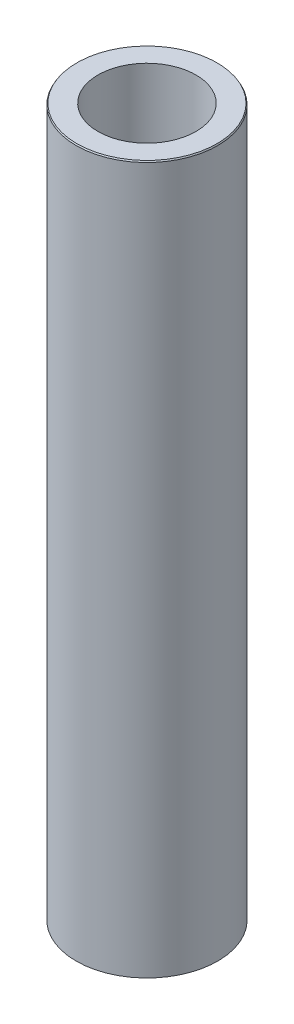
ISO-10303-21;
HEADER;
FILE_DESCRIPTION(('STEP AP214'),'2;1');
FILE_NAME('part.step','',(''),(''),'','','');
FILE_SCHEMA(('AUTOMOTIVE_DESIGN { 1 0 10303 214 1 1 1 1 }'));
ENDSEC;
DATA;
#1=APPLICATION_CONTEXT('core data for automotive mechanical design processes');
#2=APPLICATION_PROTOCOL_DEFINITION('international standard','automotive_design',2000,#1);
#3=PRODUCT_CONTEXT('',#1,'mechanical');
#4=PRODUCT('Part','Part','',(#3));
#5=PRODUCT_RELATED_PRODUCT_CATEGORY('part','',(#4));
#6=PRODUCT_DEFINITION_FORMATION('','',#4);
#7=PRODUCT_DEFINITION_CONTEXT('part definition',#1,'design');
#8=PRODUCT_DEFINITION('design','',#6,#7);
#9=PRODUCT_DEFINITION_SHAPE('','',#8);
#10=(LENGTH_UNIT() NAMED_UNIT(*) SI_UNIT(.MILLI.,.METRE.));
#11=(NAMED_UNIT(*) PLANE_ANGLE_UNIT() SI_UNIT($,.RADIAN.));
#12=(NAMED_UNIT(*) SI_UNIT($,.STERADIAN.) SOLID_ANGLE_UNIT());
#13=UNCERTAINTY_MEASURE_WITH_UNIT(LENGTH_MEASURE(1.E-05),#10,'distance_accuracy_value','');
#14=(GEOMETRIC_REPRESENTATION_CONTEXT(3) GLOBAL_UNCERTAINTY_ASSIGNED_CONTEXT((#13)) GLOBAL_UNIT_ASSIGNED_CONTEXT((#10,
#11,#12)) REPRESENTATION_CONTEXT('',''));
#15=CARTESIAN_POINT('',(0.,0.,0.));
#16=DIRECTION('',(0.,0.,1.));
#17=DIRECTION('',(1.,0.,0.));
#18=AXIS2_PLACEMENT_3D('',#15,#16,#17);
#19=CARTESIAN_POINT('',(0.,600.,0.));
#20=DIRECTION('',(0.,-1.,0.));
#21=DIRECTION('',(0.,0.,-1.));
#22=AXIS2_PLACEMENT_3D('',#19,#20,#21);
#23=CYLINDRICAL_SURFACE('',#22,60.);
#24=CARTESIAN_POINT('',(0.,598.909788159018,0.));
#25=DIRECTION('',(0.,1.,0.));
#26=DIRECTION('',(0.,0.,1.));
#27=AXIS2_PLACEMENT_3D('',#24,#25,#26);
#28=CIRCLE('',#27,60.);
#29=CARTESIAN_POINT('',(0.,598.909788159018,60.));
#30=VERTEX_POINT('',#29);
#31=EDGE_CURVE('E50',#30,#30,#28,.F.);
#32=ORIENTED_EDGE('',*,*,#31,.T.);
#33=EDGE_LOOP('',(#32));
#34=FACE_BOUND('',#33,.T.);
#35=CARTESIAN_POINT('',(0.,0.62943409986449,0.));
#36=DIRECTION('',(0.,1.,0.));
#37=DIRECTION('',(0.,0.,1.));
#38=AXIS2_PLACEMENT_3D('',#35,#36,#37);
#39=CIRCLE('',#38,60.);
#40=CARTESIAN_POINT('',(0.,0.62943409986449,60.));
#41=VERTEX_POINT('',#40);
#42=EDGE_CURVE('E51',#41,#41,#39,.T.);
#43=ORIENTED_EDGE('',*,*,#42,.T.);
#44=EDGE_LOOP('',(#43));
#45=FACE_BOUND('',#44,.T.);
#46=ADVANCED_FACE('F39',(#34,#45),#23,.T.);
#47=CARTESIAN_POINT('',(0.,600.,0.));
#48=DIRECTION('',(0.,1.,0.));
#49=DIRECTION('',(0.,0.,1.));
#50=AXIS2_PLACEMENT_3D('',#47,#48,#49);
#51=PLANE('',#50);
#52=CARTESIAN_POINT('',(0.,600.,0.));
#53=DIRECTION('',(0.,1.,0.));
#54=DIRECTION('',(0.,0.,1.));
#55=AXIS2_PLACEMENT_3D('',#52,#53,#54);
#56=CIRCLE('',#55,59.3705659001356);
#57=CARTESIAN_POINT('',(0.,600.,59.3705659001356));
#58=VERTEX_POINT('',#57);
#59=EDGE_CURVE('E54',#58,#58,#56,.T.);
#60=ORIENTED_EDGE('',*,*,#59,.T.);
#61=EDGE_LOOP('',(#60));
#62=FACE_BOUND('',#61,.T.);
#63=CARTESIAN_POINT('',(0.,600.,0.));
#64=DIRECTION('',(0.,1.,0.));
#65=DIRECTION('',(0.,0.,1.));
#66=AXIS2_PLACEMENT_3D('',#63,#64,#65);
#67=CIRCLE('',#66,41.5115025601085);
#68=CARTESIAN_POINT('',(0.,600.,41.5115025601085));
#69=VERTEX_POINT('',#68);
#70=EDGE_CURVE('E58',#69,#69,#67,.T.);
#71=ORIENTED_EDGE('',*,*,#70,.F.);
#72=EDGE_LOOP('',(#71));
#73=FACE_BOUND('',#72,.T.);
#74=ADVANCED_FACE('F69',(#62,#73),#51,.T.);
#75=CARTESIAN_POINT('',(0.,0.,0.));
#76=DIRECTION('',(0.,1.,0.));
#77=DIRECTION('',(0.,0.,1.));
#78=AXIS2_PLACEMENT_3D('',#75,#76,#77);
#79=PLANE('',#78);
#80=CARTESIAN_POINT('',(0.,0.,0.));
#81=DIRECTION('',(0.,1.,0.));
#82=DIRECTION('',(0.,0.,1.));
#83=AXIS2_PLACEMENT_3D('',#80,#81,#82);
#84=CIRCLE('',#83,58.9097881590181);
#85=CARTESIAN_POINT('',(0.,0.,58.9097881590181));
#86=VERTEX_POINT('',#85);
#87=EDGE_CURVE('E10',#86,#86,#84,.F.);
#88=ORIENTED_EDGE('',*,*,#87,.T.);
#89=EDGE_LOOP('',(#88));
#90=FACE_BOUND('',#89,.T.);
#91=CARTESIAN_POINT('',(0.,0.,0.));
#92=DIRECTION('',(0.,1.,0.));
#93=DIRECTION('',(0.,0.,1.));
#94=AXIS2_PLACEMENT_3D('',#91,#92,#93);
#95=CIRCLE('',#94,41.5115025601085);
#96=CARTESIAN_POINT('',(0.,0.,41.5115025601085));
#97=VERTEX_POINT('',#96);
#98=EDGE_CURVE('E63',#97,#97,#95,.T.);
#99=ORIENTED_EDGE('',*,*,#98,.T.);
#100=EDGE_LOOP('',(#99));
#101=FACE_BOUND('',#100,.T.);
#102=ADVANCED_FACE('F75',(#90,#101),#79,.F.);
#103=CARTESIAN_POINT('',(0.,600.,0.));
#104=DIRECTION('',(0.,-1.,0.));
#105=DIRECTION('',(0.,0.,-1.));
#106=AXIS2_PLACEMENT_3D('',#103,#104,#105);
#107=CYLINDRICAL_SURFACE('',#106,41.5115025601085);
#108=ORIENTED_EDGE('',*,*,#70,.T.);
#109=EDGE_LOOP('',(#108));
#110=FACE_BOUND('',#109,.T.);
#111=ORIENTED_EDGE('',*,*,#98,.F.);
#112=EDGE_LOOP('',(#111));
#113=FACE_BOUND('',#112,.T.);
#114=ADVANCED_FACE('F70',(#110,#113),#107,.F.);
#115=CARTESIAN_POINT('',(0.,600.,0.));
#116=DIRECTION('',(0.,-1.,0.));
#117=DIRECTION('',(0.,0.,-1.));
#118=AXIS2_PLACEMENT_3D('',#115,#116,#117);
#119=CONICAL_SURFACE('',#118,59.3705659001356,0.52359877559831);
#120=ORIENTED_EDGE('',*,*,#31,.F.);
#121=EDGE_LOOP('',(#120));
#122=FACE_BOUND('',#121,.T.);
#123=ORIENTED_EDGE('',*,*,#59,.F.);
#124=EDGE_LOOP('',(#123));
#125=FACE_BOUND('',#124,.T.);
#126=ADVANCED_FACE('F81',(#122,#125),#119,.T.);
#127=CARTESIAN_POINT('',(0.,0.62943409986449,0.));
#128=DIRECTION('',(0.,1.,0.));
#129=DIRECTION('',(0.,0.,1.));
#130=AXIS2_PLACEMENT_3D('',#127,#128,#129);
#131=CONICAL_SURFACE('',#130,60.,1.04719755119666);
#132=ORIENTED_EDGE('',*,*,#87,.F.);
#133=EDGE_LOOP('',(#132));
#134=FACE_BOUND('',#133,.T.);
#135=ORIENTED_EDGE('',*,*,#42,.F.);
#136=EDGE_LOOP('',(#135));
#137=FACE_BOUND('',#136,.T.);
#138=ADVANCED_FACE('F45',(#134,#137),#131,.T.);
#139=CLOSED_SHELL('',(#46,#74,#102,#114,#126,#138));
#140=MANIFOLD_SOLID_BREP('B2',#139);
#141=ADVANCED_BREP_SHAPE_REPRESENTATION('',(#18,#140),#14);
#142=SHAPE_DEFINITION_REPRESENTATION(#9,#141);
ENDSEC;
END-ISO-10303-21;
